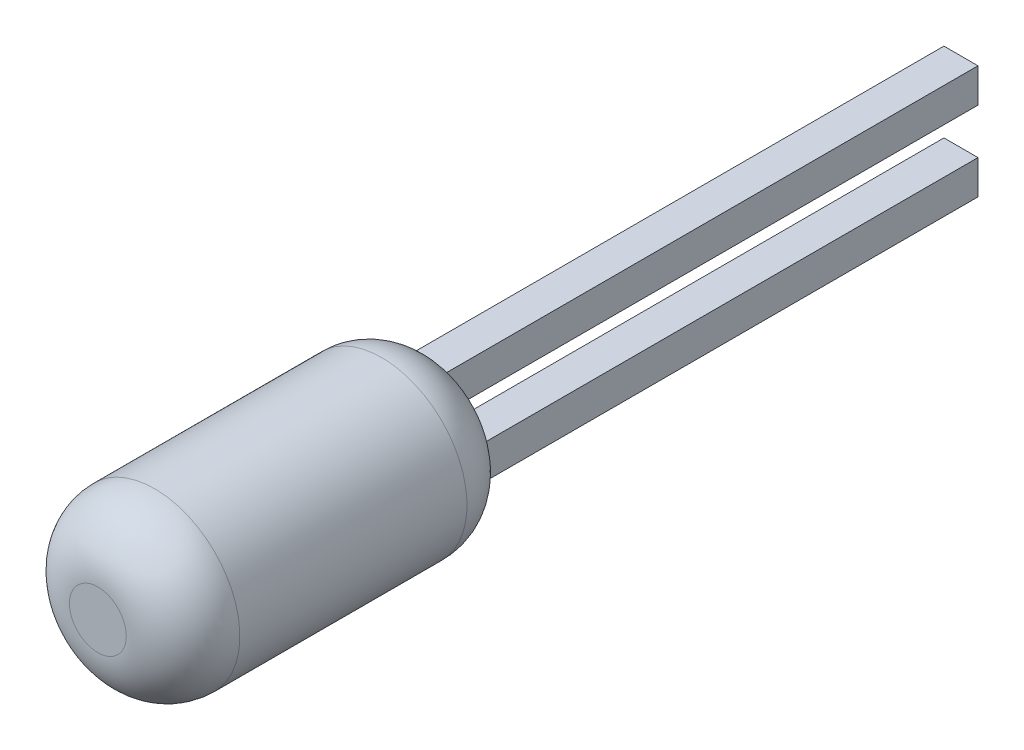
ISO-10303-21;
HEADER;
FILE_DESCRIPTION(('STEP AP214'),'2;1');
FILE_NAME('part.step','',(''),(''),'','','');
FILE_SCHEMA(('AUTOMOTIVE_DESIGN { 1 0 10303 214 1 1 1 1 }'));
ENDSEC;
DATA;
#1=APPLICATION_CONTEXT('core data for automotive mechanical design processes');
#2=APPLICATION_PROTOCOL_DEFINITION('international standard','automotive_design',2000,#1);
#3=PRODUCT_CONTEXT('',#1,'mechanical');
#4=PRODUCT('Part','Part','',(#3));
#5=PRODUCT_RELATED_PRODUCT_CATEGORY('part','',(#4));
#6=PRODUCT_DEFINITION_FORMATION('','',#4);
#7=PRODUCT_DEFINITION_CONTEXT('part definition',#1,'design');
#8=PRODUCT_DEFINITION('design','',#6,#7);
#9=PRODUCT_DEFINITION_SHAPE('','',#8);
#10=(LENGTH_UNIT() NAMED_UNIT(*) SI_UNIT(.MILLI.,.METRE.));
#11=(NAMED_UNIT(*) PLANE_ANGLE_UNIT() SI_UNIT($,.RADIAN.));
#12=(NAMED_UNIT(*) SI_UNIT($,.STERADIAN.) SOLID_ANGLE_UNIT());
#13=UNCERTAINTY_MEASURE_WITH_UNIT(LENGTH_MEASURE(1.E-05),#10,'distance_accuracy_value','');
#14=(GEOMETRIC_REPRESENTATION_CONTEXT(3) GLOBAL_UNCERTAINTY_ASSIGNED_CONTEXT((#13)) GLOBAL_UNIT_ASSIGNED_CONTEXT((#10,
#11,#12)) REPRESENTATION_CONTEXT('',''));
#15=CARTESIAN_POINT('',(0.,0.,0.));
#16=DIRECTION('',(0.,0.,1.));
#17=DIRECTION('',(1.,0.,0.));
#18=AXIS2_PLACEMENT_3D('',#15,#16,#17);
#19=CARTESIAN_POINT('',(0.15,-0.5,-2.));
#20=DIRECTION('',(0.,-1.,0.));
#21=DIRECTION('',(0.,0.,-1.));
#22=AXIS2_PLACEMENT_3D('',#19,#20,#21);
#23=PLANE('',#22);
#24=DIRECTION('',(0.,0.,-1.));
#25=VECTOR('',#24,1.);
#26=CARTESIAN_POINT('',(0.15,-0.5,-2.));
#27=LINE('',#26,#25);
#28=CARTESIAN_POINT('',(0.15,-0.5,-2.));
#29=VERTEX_POINT('',#28);
#30=CARTESIAN_POINT('',(0.15,-0.5,-7.60000004768372));
#31=VERTEX_POINT('',#30);
#32=EDGE_CURVE('P0_E68',#29,#31,#27,.T.);
#33=ORIENTED_EDGE('',*,*,#32,.F.);
#34=DIRECTION('',(1.,0.,0.));
#35=VECTOR('',#34,1.);
#36=CARTESIAN_POINT('',(0.,-0.5,-2.));
#37=LINE('',#36,#35);
#38=CARTESIAN_POINT('',(-0.15,-0.5,-2.));
#39=VERTEX_POINT('',#38);
#40=EDGE_CURVE('P0_E55',#39,#29,#37,.T.);
#41=ORIENTED_EDGE('',*,*,#40,.F.);
#42=DIRECTION('',(0.,0.,1.));
#43=VECTOR('',#42,1.);
#44=CARTESIAN_POINT('',(-0.15,-0.5,-2.));
#45=LINE('',#44,#43);
#46=CARTESIAN_POINT('',(-0.15,-0.5,-7.60000004768372));
#47=VERTEX_POINT('',#46);
#48=EDGE_CURVE('P0_E61',#47,#39,#45,.T.);
#49=ORIENTED_EDGE('',*,*,#48,.F.);
#50=DIRECTION('',(1.,0.,0.));
#51=VECTOR('',#50,1.);
#52=CARTESIAN_POINT('',(0.15,-0.5,-7.60000004768372));
#53=LINE('',#52,#51);
#54=EDGE_CURVE('P0_E19',#47,#31,#53,.T.);
#55=ORIENTED_EDGE('',*,*,#54,.T.);
#56=EDGE_LOOP('',(#33,#41,#49,#55));
#57=FACE_BOUND('',#56,.T.);
#58=ADVANCED_FACE('P0_F16',(#57),#23,.T.);
#59=CARTESIAN_POINT('',(-0.15,-0.5,-2.));
#60=DIRECTION('',(-1.,0.,0.));
#61=DIRECTION('',(0.,-1.,0.));
#62=AXIS2_PLACEMENT_3D('',#59,#60,#61);
#63=PLANE('',#62);
#64=DIRECTION('',(0.,0.,1.));
#65=VECTOR('',#64,1.);
#66=CARTESIAN_POINT('',(-0.150000114788744,-0.2,-2.));
#67=LINE('',#66,#65);
#68=CARTESIAN_POINT('',(-0.150000028697186,-0.2,-7.60000004768372));
#69=VERTEX_POINT('',#68);
#70=CARTESIAN_POINT('',(-0.150000028697186,-0.2,-2.));
#71=VERTEX_POINT('',#70);
#72=EDGE_CURVE('P0_E82',#69,#71,#67,.T.);
#73=ORIENTED_EDGE('',*,*,#72,.F.);
#74=DIRECTION('',(0.,1.,0.));
#75=VECTOR('',#74,1.);
#76=CARTESIAN_POINT('',(-0.15,-0.2,-7.60000004768372));
#77=LINE('',#76,#75);
#78=EDGE_CURVE('P0_E66',#47,#69,#77,.T.);
#79=ORIENTED_EDGE('',*,*,#78,.F.);
#80=ORIENTED_EDGE('',*,*,#48,.T.);
#81=DIRECTION('',(0.,1.,0.));
#82=VECTOR('',#81,1.);
#83=CARTESIAN_POINT('',(-0.15,0.,-2.));
#84=LINE('',#83,#82);
#85=EDGE_CURVE('P0_E63',#71,#39,#84,.F.);
#86=ORIENTED_EDGE('',*,*,#85,.F.);
#87=EDGE_LOOP('',(#73,#79,#80,#86));
#88=FACE_BOUND('',#87,.T.);
#89=ADVANCED_FACE('P0_F62',(#88),#63,.T.);
#90=CARTESIAN_POINT('',(0.,0.,-2.));
#91=DIRECTION('',(0.,0.,1.));
#92=DIRECTION('',(1.,0.,0.));
#93=AXIS2_PLACEMENT_3D('',#90,#91,#92);
#94=PLANE('',#93);
#95=ORIENTED_EDGE('',*,*,#85,.T.);
#96=ORIENTED_EDGE('',*,*,#40,.T.);
#97=DIRECTION('',(0.,1.,0.));
#98=VECTOR('',#97,1.);
#99=CARTESIAN_POINT('',(0.15,-0.5,-2.));
#100=LINE('',#99,#98);
#101=CARTESIAN_POINT('',(0.15,-0.2,-2.));
#102=VERTEX_POINT('',#101);
#103=EDGE_CURVE('P0_E70',#102,#29,#100,.F.);
#104=ORIENTED_EDGE('',*,*,#103,.F.);
#105=DIRECTION('',(1.,0.,0.));
#106=VECTOR('',#105,1.);
#107=CARTESIAN_POINT('',(0.15,-0.2,-2.));
#108=LINE('',#107,#106);
#109=EDGE_CURVE('P0_E74',#71,#102,#108,.T.);
#110=ORIENTED_EDGE('',*,*,#109,.F.);
#111=EDGE_LOOP('',(#95,#96,#104,#110));
#112=FACE_BOUND('',#111,.T.);
#113=ADVANCED_FACE('P0_F72',(#112),#94,.T.);
#114=CARTESIAN_POINT('',(0.15,-0.5,-2.));
#115=DIRECTION('',(1.,0.,0.));
#116=DIRECTION('',(0.,0.,-1.));
#117=AXIS2_PLACEMENT_3D('',#114,#115,#116);
#118=PLANE('',#117);
#119=ORIENTED_EDGE('',*,*,#32,.T.);
#120=DIRECTION('',(0.,1.,0.));
#121=VECTOR('',#120,1.);
#122=CARTESIAN_POINT('',(0.15,-0.2,-7.60000004768372));
#123=LINE('',#122,#121);
#124=CARTESIAN_POINT('',(0.15,-0.2,-7.60000004768372));
#125=VERTEX_POINT('',#124);
#126=EDGE_CURVE('P0_E34',#125,#31,#123,.F.);
#127=ORIENTED_EDGE('',*,*,#126,.F.);
#128=DIRECTION('',(0.,0.,1.));
#129=VECTOR('',#128,1.);
#130=CARTESIAN_POINT('',(0.15,-0.2,-2.));
#131=LINE('',#130,#129);
#132=EDGE_CURVE('P0_E25',#102,#125,#131,.F.);
#133=ORIENTED_EDGE('',*,*,#132,.F.);
#134=ORIENTED_EDGE('',*,*,#103,.T.);
#135=EDGE_LOOP('',(#119,#127,#133,#134));
#136=FACE_BOUND('',#135,.T.);
#137=ADVANCED_FACE('P0_F88',(#136),#118,.T.);
#138=CARTESIAN_POINT('',(-0.5,-0.2,-7.60000004768372));
#139=DIRECTION('',(0.,0.,-1.));
#140=DIRECTION('',(-1.,0.,0.));
#141=AXIS2_PLACEMENT_3D('',#138,#139,#140);
#142=PLANE('',#141);
#143=ORIENTED_EDGE('',*,*,#54,.F.);
#144=ORIENTED_EDGE('',*,*,#78,.T.);
#145=DIRECTION('',(1.,0.,0.));
#146=VECTOR('',#145,1.);
#147=CARTESIAN_POINT('',(0.15,-0.2,-7.60000004768372));
#148=LINE('',#147,#146);
#149=EDGE_CURVE('P0_E11',#125,#69,#148,.F.);
#150=ORIENTED_EDGE('',*,*,#149,.F.);
#151=ORIENTED_EDGE('',*,*,#126,.T.);
#152=EDGE_LOOP('',(#143,#144,#150,#151));
#153=FACE_BOUND('',#152,.T.);
#154=ADVANCED_FACE('P0_F90',(#153),#142,.T.);
#155=CARTESIAN_POINT('',(0.15,-0.2,-2.));
#156=DIRECTION('',(0.,1.,0.));
#157=DIRECTION('',(0.,0.,1.));
#158=AXIS2_PLACEMENT_3D('',#155,#156,#157);
#159=PLANE('',#158);
#160=ORIENTED_EDGE('',*,*,#132,.T.);
#161=ORIENTED_EDGE('',*,*,#149,.T.);
#162=ORIENTED_EDGE('',*,*,#72,.T.);
#163=ORIENTED_EDGE('',*,*,#109,.T.);
#164=EDGE_LOOP('',(#160,#161,#162,#163));
#165=FACE_BOUND('',#164,.T.);
#166=ADVANCED_FACE('P0_F87',(#165),#159,.T.);
#167=CLOSED_SHELL('',(#58,#89,#113,#137,#154,#166));
#168=MANIFOLD_SOLID_BREP('P0_B1',#167);
#169=CARTESIAN_POINT('',(0.,0.,0.));
#170=DIRECTION('',(0.,0.,1.));
#171=DIRECTION('',(1.,0.,0.));
#172=AXIS2_PLACEMENT_3D('',#169,#170,#171);
#173=PLANE('',#172);
#174=CARTESIAN_POINT('',(0.25,0.,0.));
#175=CARTESIAN_POINT('',(0.25,0.103237276819228,0.));
#176=CARTESIAN_POINT('',(0.176776695296637,0.176776695296637,0.));
#177=CARTESIAN_POINT('',(0.104088194147068,0.249779001409273,0.));
#178=CARTESIAN_POINT('',(0.,0.25,0.));
#179=CARTESIAN_POINT('',(-0.103017607019714,0.250218725535187,0.));
#180=CARTESIAN_POINT('',(-0.176776695296637,0.176776695296637,0.));
#181=CARTESIAN_POINT('',(-0.213093640622038,0.140615860624358,0.));
#182=CARTESIAN_POINT('',(-0.232447075265608,0.0920236773904682,0.));
#183=CARTESIAN_POINT('',(-0.25,0.0479521753189915,0.));
#184=CARTESIAN_POINT('',(-0.25,0.,0.));
#185=B_SPLINE_CURVE_WITH_KNOTS('',2,(#174,#175,#176,#177,#178,#179,#180,#181,#182,#183,#184),
.UNSPECIFIED.,.F.,.F.,(3,2,2,2,2,3),(0.,0.25,0.5,0.75,0.875,1.),.UNSPECIFIED.);
#186=CARTESIAN_POINT('',(0.25,0.,0.));
#187=VERTEX_POINT('',#186);
#188=CARTESIAN_POINT('',(-0.25,0.,0.));
#189=VERTEX_POINT('',#188);
#190=EDGE_CURVE('P1_E45',#187,#189,#185,.T.);
#191=ORIENTED_EDGE('',*,*,#190,.T.);
#192=CARTESIAN_POINT('',(-0.25,0.,0.));
#193=CARTESIAN_POINT('',(-0.25,-0.103237276819231,0.));
#194=CARTESIAN_POINT('',(-0.176776695296637,-0.176776695296637,0.));
#195=CARTESIAN_POINT('',(-0.104088194147071,-0.249779001409267,0.));
#196=CARTESIAN_POINT('',(0.,-0.25,0.));
#197=CARTESIAN_POINT('',(0.103017607019715,-0.250218725535193,0.));
#198=CARTESIAN_POINT('',(0.176776695296637,-0.176776695296637,0.));
#199=CARTESIAN_POINT('',(0.213093640622048,-0.140615860624344,0.));
#200=CARTESIAN_POINT('',(0.232447075265608,-0.0920236773904683,0.));
#201=CARTESIAN_POINT('',(0.25,-0.0479521753189811,0.));
#202=CARTESIAN_POINT('',(0.25,0.,0.));
#203=B_SPLINE_CURVE_WITH_KNOTS('',2,(#192,#193,#194,#195,#196,#197,#198,#199,#200,#201,#202),
.UNSPECIFIED.,.F.,.F.,(3,2,2,2,2,3),(0.,0.25,0.5,0.75,0.875,1.),.UNSPECIFIED.);
#204=EDGE_CURVE('P1_E20',#189,#187,#203,.T.);
#205=ORIENTED_EDGE('',*,*,#204,.T.);
#206=EDGE_LOOP('',(#191,#205));
#207=FACE_BOUND('',#206,.T.);
#208=ADVANCED_FACE('P1_F16',(#207),#173,.T.);
#209=CARTESIAN_POINT('',(0.,0.,-3.));
#210=DIRECTION('',(0.,0.,-1.));
#211=DIRECTION('',(-1.,0.,0.));
#212=AXIS2_PLACEMENT_3D('',#209,#210,#211);
#213=PLANE('',#212);
#214=CARTESIAN_POINT('',(-0.25,0.,-3.));
#215=CARTESIAN_POINT('',(-0.25,0.103237276819228,-3.));
#216=CARTESIAN_POINT('',(-0.176776695296637,0.176776695296637,-3.));
#217=CARTESIAN_POINT('',(-0.104088194147068,0.249779001409273,-3.));
#218=CARTESIAN_POINT('',(0.,0.25,-3.));
#219=CARTESIAN_POINT('',(0.103017607019714,0.250218725535187,-3.));
#220=CARTESIAN_POINT('',(0.176776695296637,0.176776695296637,-3.));
#221=CARTESIAN_POINT('',(0.213093640622038,0.140615860624358,-3.));
#222=CARTESIAN_POINT('',(0.232447075265608,0.0920236773904682,-3.));
#223=CARTESIAN_POINT('',(0.25,0.0479521753189915,-3.));
#224=CARTESIAN_POINT('',(0.25,0.,-3.));
#225=B_SPLINE_CURVE_WITH_KNOTS('',2,(#214,#215,#216,#217,#218,#219,#220,#221,#222,#223,#224),
.UNSPECIFIED.,.F.,.F.,(3,2,2,2,2,3),(0.,0.25,0.5,0.75,0.875,1.),.UNSPECIFIED.);
#226=CARTESIAN_POINT('',(-0.25,0.,-3.));
#227=VERTEX_POINT('',#226);
#228=CARTESIAN_POINT('',(0.25,0.,-3.));
#229=VERTEX_POINT('',#228);
#230=EDGE_CURVE('P1_E70',#227,#229,#225,.T.);
#231=ORIENTED_EDGE('',*,*,#230,.T.);
#232=CARTESIAN_POINT('',(0.25,0.,-3.));
#233=CARTESIAN_POINT('',(0.25,-0.103237276819231,-3.));
#234=CARTESIAN_POINT('',(0.176776695296637,-0.176776695296637,-3.));
#235=CARTESIAN_POINT('',(0.104088194147071,-0.249779001409267,-3.));
#236=CARTESIAN_POINT('',(0.,-0.25,-3.));
#237=CARTESIAN_POINT('',(-0.103017607019715,-0.250218725535193,-3.));
#238=CARTESIAN_POINT('',(-0.176776695296637,-0.176776695296637,-3.));
#239=CARTESIAN_POINT('',(-0.213093640622048,-0.140615860624344,-3.));
#240=CARTESIAN_POINT('',(-0.232447075265608,-0.0920236773904683,-3.));
#241=CARTESIAN_POINT('',(-0.25,-0.0479521753189811,-3.));
#242=CARTESIAN_POINT('',(-0.25,0.,-3.));
#243=B_SPLINE_CURVE_WITH_KNOTS('',2,(#232,#233,#234,#235,#236,#237,#238,#239,#240,#241,#242),
.UNSPECIFIED.,.F.,.F.,(3,2,2,2,2,3),(0.,0.25,0.5,0.75,0.875,1.),.UNSPECIFIED.);
#244=EDGE_CURVE('P1_E36',#229,#227,#243,.T.);
#245=ORIENTED_EDGE('',*,*,#244,.T.);
#246=EDGE_LOOP('',(#231,#245));
#247=FACE_BOUND('',#246,.T.);
#248=ADVANCED_FACE('P1_F49',(#247),#213,.T.);
#249=CARTESIAN_POINT('',(0.,0.,-0.5));
#250=DIRECTION('',(0.,0.,1.));
#251=DIRECTION('',(1.,0.,0.));
#252=AXIS2_PLACEMENT_3D('',#249,#250,#251);
#253=DEGENERATE_TOROIDAL_SURFACE('',#252,0.25,0.5,.T.);
#254=CARTESIAN_POINT('',(0.,0.,-0.5));
#255=DIRECTION('',(0.,0.,-1.));
#256=DIRECTION('',(-1.,0.,0.));
#257=AXIS2_PLACEMENT_3D('',#254,#255,#256);
#258=CIRCLE('',#257,0.75);
#259=CARTESIAN_POINT('',(-0.75,0.,-0.5));
#260=VERTEX_POINT('',#259);
#261=EDGE_CURVE('P1_E28',#260,#260,#258,.T.);
#262=ORIENTED_EDGE('',*,*,#261,.F.);
#263=EDGE_LOOP('',(#262));
#264=FACE_BOUND('',#263,.T.);
#265=ORIENTED_EDGE('',*,*,#204,.F.);
#266=ORIENTED_EDGE('',*,*,#190,.F.);
#267=EDGE_LOOP('',(#265,#266));
#268=FACE_BOUND('',#267,.T.);
#269=ADVANCED_FACE('P1_F47',(#264,#268),#253,.T.);
#270=CARTESIAN_POINT('',(0.,0.,-2.5));
#271=DIRECTION('',(0.,0.,-1.));
#272=DIRECTION('',(-1.,0.,0.));
#273=AXIS2_PLACEMENT_3D('',#270,#271,#272);
#274=DEGENERATE_TOROIDAL_SURFACE('',#273,0.25,0.5,.T.);
#275=CARTESIAN_POINT('',(0.,0.,-2.5));
#276=DIRECTION('',(0.,0.,-1.));
#277=DIRECTION('',(-1.,0.,0.));
#278=AXIS2_PLACEMENT_3D('',#275,#276,#277);
#279=CIRCLE('',#278,0.75);
#280=CARTESIAN_POINT('',(-0.75,0.,-2.5));
#281=VERTEX_POINT('',#280);
#282=EDGE_CURVE('P1_E11',#281,#281,#279,.F.);
#283=ORIENTED_EDGE('',*,*,#282,.F.);
#284=EDGE_LOOP('',(#283));
#285=FACE_BOUND('',#284,.T.);
#286=ORIENTED_EDGE('',*,*,#244,.F.);
#287=ORIENTED_EDGE('',*,*,#230,.F.);
#288=EDGE_LOOP('',(#286,#287));
#289=FACE_BOUND('',#288,.T.);
#290=ADVANCED_FACE('P1_F18',(#285,#289),#274,.T.);
#291=CARTESIAN_POINT('',(0.,0.,0.));
#292=DIRECTION('',(0.,0.,-1.));
#293=DIRECTION('',(-1.,0.,0.));
#294=AXIS2_PLACEMENT_3D('',#291,#292,#293);
#295=CYLINDRICAL_SURFACE('',#294,0.75);
#296=ORIENTED_EDGE('',*,*,#282,.T.);
#297=EDGE_LOOP('',(#296));
#298=FACE_BOUND('',#297,.T.);
#299=ORIENTED_EDGE('',*,*,#261,.T.);
#300=EDGE_LOOP('',(#299));
#301=FACE_BOUND('',#300,.T.);
#302=ADVANCED_FACE('P1_F56',(#298,#301),#295,.T.);
#303=CLOSED_SHELL('',(#208,#248,#269,#290,#302));
#304=MANIFOLD_SOLID_BREP('P1_B1',#303);
#305=CARTESIAN_POINT('',(0.15,0.2,-2.));
#306=DIRECTION('',(0.,-1.,0.));
#307=DIRECTION('',(0.,0.,-1.));
#308=AXIS2_PLACEMENT_3D('',#305,#306,#307);
#309=PLANE('',#308);
#310=DIRECTION('',(0.,0.,-1.));
#311=VECTOR('',#310,1.);
#312=CARTESIAN_POINT('',(0.15,0.2,-2.));
#313=LINE('',#312,#311);
#314=CARTESIAN_POINT('',(0.15,0.2,-2.));
#315=VERTEX_POINT('',#314);
#316=CARTESIAN_POINT('',(0.15,0.2,-7.60000004768372));
#317=VERTEX_POINT('',#316);
#318=EDGE_CURVE('P2_E62',#315,#317,#313,.T.);
#319=ORIENTED_EDGE('',*,*,#318,.F.);
#320=DIRECTION('',(-1.,0.,0.));
#321=VECTOR('',#320,1.);
#322=CARTESIAN_POINT('',(0.,0.2,-2.));
#323=LINE('',#322,#321);
#324=CARTESIAN_POINT('',(-0.150000028697186,0.2,-2.));
#325=VERTEX_POINT('',#324);
#326=EDGE_CURVE('P2_E55',#315,#325,#323,.T.);
#327=ORIENTED_EDGE('',*,*,#326,.T.);
#328=DIRECTION('',(0.,0.,1.));
#329=VECTOR('',#328,1.);
#330=CARTESIAN_POINT('',(-0.150000114788745,0.2,-4.5));
#331=LINE('',#330,#329);
#332=CARTESIAN_POINT('',(-0.150000028697186,0.2,-7.60000004768372));
#333=VERTEX_POINT('',#332);
#334=EDGE_CURVE('P2_E60',#333,#325,#331,.T.);
#335=ORIENTED_EDGE('',*,*,#334,.F.);
#336=DIRECTION('',(1.,0.,0.));
#337=VECTOR('',#336,1.);
#338=CARTESIAN_POINT('',(0.15,0.2,-7.60000004768372));
#339=LINE('',#338,#337);
#340=EDGE_CURVE('P2_E19',#333,#317,#339,.T.);
#341=ORIENTED_EDGE('',*,*,#340,.T.);
#342=EDGE_LOOP('',(#319,#327,#335,#341));
#343=FACE_BOUND('',#342,.T.);
#344=ADVANCED_FACE('P2_F16',(#343),#309,.T.);
#345=CARTESIAN_POINT('',(-0.150000114788745,0.,-4.5));
#346=DIRECTION('',(-1.,0.,0.));
#347=DIRECTION('',(0.,0.,1.));
#348=AXIS2_PLACEMENT_3D('',#345,#346,#347);
#349=PLANE('',#348);
#350=DIRECTION('',(0.,0.,1.));
#351=VECTOR('',#350,1.);
#352=CARTESIAN_POINT('',(-0.150000114788744,0.5,-2.));
#353=LINE('',#352,#351);
#354=CARTESIAN_POINT('',(-0.150000086091558,0.5,-7.60000004768372));
#355=VERTEX_POINT('',#354);
#356=CARTESIAN_POINT('',(-0.150000086091559,0.5,-2.));
#357=VERTEX_POINT('',#356);
#358=EDGE_CURVE('P2_E82',#355,#357,#353,.T.);
#359=ORIENTED_EDGE('',*,*,#358,.F.);
#360=DIRECTION('',(0.,1.,0.));
#361=VECTOR('',#360,1.);
#362=CARTESIAN_POINT('',(-0.15,0.5,-7.60000004768372));
#363=LINE('',#362,#361);
#364=EDGE_CURVE('P2_E70',#333,#355,#363,.T.);
#365=ORIENTED_EDGE('',*,*,#364,.F.);
#366=ORIENTED_EDGE('',*,*,#334,.T.);
#367=DIRECTION('',(0.,1.,0.));
#368=VECTOR('',#367,1.);
#369=CARTESIAN_POINT('',(-0.15,0.,-2.));
#370=LINE('',#369,#368);
#371=EDGE_CURVE('P2_E64',#325,#357,#370,.T.);
#372=ORIENTED_EDGE('',*,*,#371,.T.);
#373=EDGE_LOOP('',(#359,#365,#366,#372));
#374=FACE_BOUND('',#373,.T.);
#375=ADVANCED_FACE('P2_F67',(#374),#349,.T.);
#376=CARTESIAN_POINT('',(0.,0.,-2.));
#377=DIRECTION('',(0.,0.,-1.));
#378=DIRECTION('',(-1.,0.,0.));
#379=AXIS2_PLACEMENT_3D('',#376,#377,#378);
#380=PLANE('',#379);
#381=ORIENTED_EDGE('',*,*,#326,.F.);
#382=DIRECTION('',(0.,1.,0.));
#383=VECTOR('',#382,1.);
#384=CARTESIAN_POINT('',(0.15,0.5,-2.));
#385=LINE('',#384,#383);
#386=CARTESIAN_POINT('',(0.15,0.5,-2.));
#387=VERTEX_POINT('',#386);
#388=EDGE_CURVE('P2_E75',#387,#315,#385,.F.);
#389=ORIENTED_EDGE('',*,*,#388,.F.);
#390=DIRECTION('',(1.,0.,0.));
#391=VECTOR('',#390,1.);
#392=CARTESIAN_POINT('',(0.15,0.5,-2.));
#393=LINE('',#392,#391);
#394=EDGE_CURVE('P2_E73',#357,#387,#393,.T.);
#395=ORIENTED_EDGE('',*,*,#394,.F.);
#396=ORIENTED_EDGE('',*,*,#371,.F.);
#397=EDGE_LOOP('',(#381,#389,#395,#396));
#398=FACE_BOUND('',#397,.T.);
#399=ADVANCED_FACE('P2_F71',(#398),#380,.F.);
#400=CARTESIAN_POINT('',(0.15,0.5,-2.));
#401=DIRECTION('',(1.,0.,0.));
#402=DIRECTION('',(0.,0.,-1.));
#403=AXIS2_PLACEMENT_3D('',#400,#401,#402);
#404=PLANE('',#403);
#405=ORIENTED_EDGE('',*,*,#318,.T.);
#406=DIRECTION('',(0.,1.,0.));
#407=VECTOR('',#406,1.);
#408=CARTESIAN_POINT('',(0.15,0.5,-7.60000004768372));
#409=LINE('',#408,#407);
#410=CARTESIAN_POINT('',(0.15,0.5,-7.60000004768372));
#411=VERTEX_POINT('',#410);
#412=EDGE_CURVE('P2_E34',#411,#317,#409,.F.);
#413=ORIENTED_EDGE('',*,*,#412,.F.);
#414=DIRECTION('',(0.,0.,1.));
#415=VECTOR('',#414,1.);
#416=CARTESIAN_POINT('',(0.15,0.5,-2.));
#417=LINE('',#416,#415);
#418=EDGE_CURVE('P2_E25',#387,#411,#417,.F.);
#419=ORIENTED_EDGE('',*,*,#418,.F.);
#420=ORIENTED_EDGE('',*,*,#388,.T.);
#421=EDGE_LOOP('',(#405,#413,#419,#420));
#422=FACE_BOUND('',#421,.T.);
#423=ADVANCED_FACE('P2_F88',(#422),#404,.T.);
#424=CARTESIAN_POINT('',(-0.5,0.5,-7.60000004768372));
#425=DIRECTION('',(0.,0.,-1.));
#426=DIRECTION('',(-1.,0.,0.));
#427=AXIS2_PLACEMENT_3D('',#424,#425,#426);
#428=PLANE('',#427);
#429=ORIENTED_EDGE('',*,*,#340,.F.);
#430=ORIENTED_EDGE('',*,*,#364,.T.);
#431=DIRECTION('',(1.,0.,0.));
#432=VECTOR('',#431,1.);
#433=CARTESIAN_POINT('',(0.15,0.5,-7.60000004768372));
#434=LINE('',#433,#432);
#435=EDGE_CURVE('P2_E11',#411,#355,#434,.F.);
#436=ORIENTED_EDGE('',*,*,#435,.F.);
#437=ORIENTED_EDGE('',*,*,#412,.T.);
#438=EDGE_LOOP('',(#429,#430,#436,#437));
#439=FACE_BOUND('',#438,.T.);
#440=ADVANCED_FACE('P2_F90',(#439),#428,.T.);
#441=CARTESIAN_POINT('',(0.15,0.5,-2.));
#442=DIRECTION('',(0.,1.,0.));
#443=DIRECTION('',(0.,0.,1.));
#444=AXIS2_PLACEMENT_3D('',#441,#442,#443);
#445=PLANE('',#444);
#446=ORIENTED_EDGE('',*,*,#418,.T.);
#447=ORIENTED_EDGE('',*,*,#435,.T.);
#448=ORIENTED_EDGE('',*,*,#358,.T.);
#449=ORIENTED_EDGE('',*,*,#394,.T.);
#450=EDGE_LOOP('',(#446,#447,#448,#449));
#451=FACE_BOUND('',#450,.T.);
#452=ADVANCED_FACE('P2_F87',(#451),#445,.T.);
#453=CLOSED_SHELL('',(#344,#375,#399,#423,#440,#452));
#454=MANIFOLD_SOLID_BREP('P2_B1',#453);
#455=ADVANCED_BREP_SHAPE_REPRESENTATION('',(#18,#168,#304,#454),#14);
#456=SHAPE_DEFINITION_REPRESENTATION(#9,#455);
ENDSEC;
END-ISO-10303-21;
